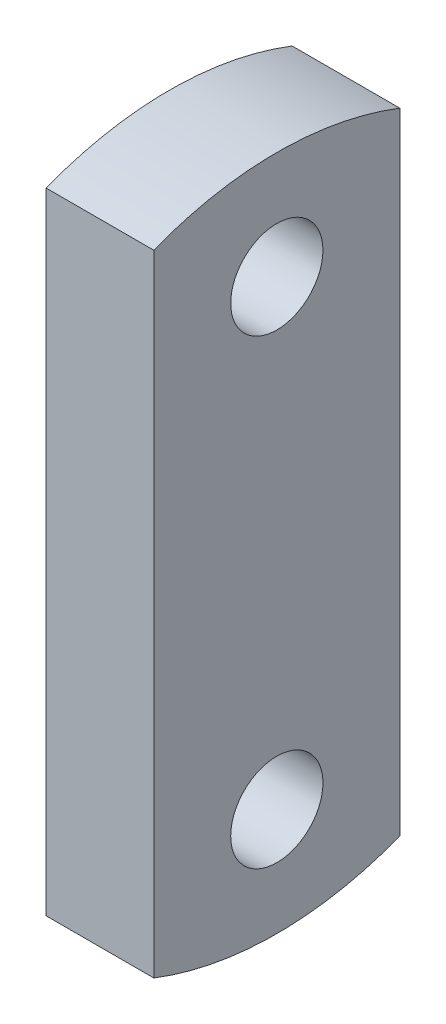
ISO-10303-21;
HEADER;
FILE_DESCRIPTION(('STEP AP214'),'2;1');
FILE_NAME('part.step','',(''),(''),'','','');
FILE_SCHEMA(('AUTOMOTIVE_DESIGN { 1 0 10303 214 1 1 1 1 }'));
ENDSEC;
DATA;
#1=APPLICATION_CONTEXT('core data for automotive mechanical design processes');
#2=APPLICATION_PROTOCOL_DEFINITION('international standard','automotive_design',2000,#1);
#3=PRODUCT_CONTEXT('',#1,'mechanical');
#4=PRODUCT('Part','Part','',(#3));
#5=PRODUCT_RELATED_PRODUCT_CATEGORY('part','',(#4));
#6=PRODUCT_DEFINITION_FORMATION('','',#4);
#7=PRODUCT_DEFINITION_CONTEXT('part definition',#1,'design');
#8=PRODUCT_DEFINITION('design','',#6,#7);
#9=PRODUCT_DEFINITION_SHAPE('','',#8);
#10=(LENGTH_UNIT() NAMED_UNIT(*) SI_UNIT(.MILLI.,.METRE.));
#11=(NAMED_UNIT(*) PLANE_ANGLE_UNIT() SI_UNIT($,.RADIAN.));
#12=(NAMED_UNIT(*) SI_UNIT($,.STERADIAN.) SOLID_ANGLE_UNIT());
#13=UNCERTAINTY_MEASURE_WITH_UNIT(LENGTH_MEASURE(1.E-05),#10,'distance_accuracy_value','');
#14=(GEOMETRIC_REPRESENTATION_CONTEXT(3) GLOBAL_UNCERTAINTY_ASSIGNED_CONTEXT((#13)) GLOBAL_UNIT_ASSIGNED_CONTEXT((#10,
#11,#12)) REPRESENTATION_CONTEXT('',''));
#15=CARTESIAN_POINT('',(0.,0.,0.));
#16=DIRECTION('',(0.,0.,1.));
#17=DIRECTION('',(1.,0.,0.));
#18=AXIS2_PLACEMENT_3D('',#15,#16,#17);
#19=CARTESIAN_POINT('',(35.,0.,0.));
#20=DIRECTION('',(1.,0.,0.));
#21=DIRECTION('',(0.,0.,-1.));
#22=AXIS2_PLACEMENT_3D('',#19,#20,#21);
#23=PLANE('',#22);
#24=CARTESIAN_POINT('',(35.,75.,0.));
#25=DIRECTION('',(1.,0.,0.));
#26=DIRECTION('',(0.,0.,-1.));
#27=AXIS2_PLACEMENT_3D('',#24,#25,#26);
#28=CIRCLE('',#27,15.);
#29=CARTESIAN_POINT('',(35.,75.,-15.));
#30=VERTEX_POINT('',#29);
#31=EDGE_CURVE('E120',#30,#30,#28,.T.);
#32=ORIENTED_EDGE('',*,*,#31,.F.);
#33=EDGE_LOOP('',(#32));
#34=FACE_BOUND('',#33,.T.);
#35=CARTESIAN_POINT('',(35.,0.,0.));
#36=DIRECTION('',(1.,0.,0.));
#37=DIRECTION('',(0.,0.,-1.));
#38=AXIS2_PLACEMENT_3D('',#35,#36,#37);
#39=CIRCLE('',#38,110.);
#40=CARTESIAN_POINT('',(35.,102.469507659596,-40.));
#41=VERTEX_POINT('',#40);
#42=CARTESIAN_POINT('',(35.,102.469507659596,40.));
#43=VERTEX_POINT('',#42);
#44=EDGE_CURVE('E98',#41,#43,#39,.T.);
#45=ORIENTED_EDGE('',*,*,#44,.T.);
#46=DIRECTION('',(0.,-1.,0.));
#47=VECTOR('',#46,1.);
#48=CARTESIAN_POINT('',(35.,-102.469507659596,40.));
#49=LINE('',#48,#47);
#50=CARTESIAN_POINT('',(35.,-102.469507659596,40.));
#51=VERTEX_POINT('',#50);
#52=EDGE_CURVE('E93',#43,#51,#49,.T.);
#53=ORIENTED_EDGE('',*,*,#52,.T.);
#54=CARTESIAN_POINT('',(35.,0.,0.));
#55=DIRECTION('',(1.,0.,0.));
#56=DIRECTION('',(0.,0.,-1.));
#57=AXIS2_PLACEMENT_3D('',#54,#55,#56);
#58=CIRCLE('',#57,110.);
#59=CARTESIAN_POINT('',(35.,-102.469507659596,-40.));
#60=VERTEX_POINT('',#59);
#61=EDGE_CURVE('E96',#51,#60,#58,.T.);
#62=ORIENTED_EDGE('',*,*,#61,.T.);
#63=DIRECTION('',(0.,1.,0.));
#64=VECTOR('',#63,1.);
#65=CARTESIAN_POINT('',(35.,-102.469507659596,-40.));
#66=LINE('',#65,#64);
#67=EDGE_CURVE('E63',#60,#41,#66,.T.);
#68=ORIENTED_EDGE('',*,*,#67,.T.);
#69=EDGE_LOOP('',(#45,#53,#62,#68));
#70=FACE_BOUND('',#69,.T.);
#71=CARTESIAN_POINT('',(35.,-75.,0.));
#72=DIRECTION('',(1.,0.,0.));
#73=DIRECTION('',(0.,0.,1.));
#74=AXIS2_PLACEMENT_3D('',#71,#72,#73);
#75=CIRCLE('',#74,15.);
#76=CARTESIAN_POINT('',(35.,-75.,15.));
#77=VERTEX_POINT('',#76);
#78=EDGE_CURVE('E141',#77,#77,#75,.T.);
#79=ORIENTED_EDGE('',*,*,#78,.F.);
#80=EDGE_LOOP('',(#79));
#81=FACE_BOUND('',#80,.T.);
#82=ADVANCED_FACE('F45',(#34,#70,#81),#23,.T.);
#83=CARTESIAN_POINT('',(0.,0.,0.));
#84=DIRECTION('',(1.,0.,0.));
#85=DIRECTION('',(0.,0.,-1.));
#86=AXIS2_PLACEMENT_3D('',#83,#84,#85);
#87=PLANE('',#86);
#88=CARTESIAN_POINT('',(0.,0.,0.));
#89=DIRECTION('',(1.,0.,0.));
#90=DIRECTION('',(0.,0.,-1.));
#91=AXIS2_PLACEMENT_3D('',#88,#89,#90);
#92=CIRCLE('',#91,110.);
#93=CARTESIAN_POINT('',(0.,102.469507659596,-40.));
#94=VERTEX_POINT('',#93);
#95=CARTESIAN_POINT('',(0.,102.469507659596,40.));
#96=VERTEX_POINT('',#95);
#97=EDGE_CURVE('E116',#94,#96,#92,.T.);
#98=ORIENTED_EDGE('',*,*,#97,.F.);
#99=DIRECTION('',(0.,1.,0.));
#100=VECTOR('',#99,1.);
#101=CARTESIAN_POINT('',(0.,-102.469507659596,-40.));
#102=LINE('',#101,#100);
#103=CARTESIAN_POINT('',(0.,-102.469507659596,-40.));
#104=VERTEX_POINT('',#103);
#105=EDGE_CURVE('E86',#104,#94,#102,.T.);
#106=ORIENTED_EDGE('',*,*,#105,.F.);
#107=CARTESIAN_POINT('',(0.,0.,0.));
#108=DIRECTION('',(1.,0.,0.));
#109=DIRECTION('',(0.,0.,-1.));
#110=AXIS2_PLACEMENT_3D('',#107,#108,#109);
#111=CIRCLE('',#110,110.);
#112=CARTESIAN_POINT('',(0.,-102.469507659596,40.));
#113=VERTEX_POINT('',#112);
#114=EDGE_CURVE('E80',#113,#104,#111,.T.);
#115=ORIENTED_EDGE('',*,*,#114,.F.);
#116=DIRECTION('',(0.,-1.,0.));
#117=VECTOR('',#116,1.);
#118=CARTESIAN_POINT('',(0.,-102.469507659596,40.));
#119=LINE('',#118,#117);
#120=EDGE_CURVE('E103',#96,#113,#119,.T.);
#121=ORIENTED_EDGE('',*,*,#120,.F.);
#122=EDGE_LOOP('',(#98,#106,#115,#121));
#123=FACE_BOUND('',#122,.T.);
#124=CARTESIAN_POINT('',(0.,75.,0.));
#125=DIRECTION('',(1.,0.,0.));
#126=DIRECTION('',(0.,0.,-1.));
#127=AXIS2_PLACEMENT_3D('',#124,#125,#126);
#128=CIRCLE('',#127,15.);
#129=CARTESIAN_POINT('',(0.,75.,-15.));
#130=VERTEX_POINT('',#129);
#131=EDGE_CURVE('E137',#130,#130,#128,.T.);
#132=ORIENTED_EDGE('',*,*,#131,.T.);
#133=EDGE_LOOP('',(#132));
#134=FACE_BOUND('',#133,.T.);
#135=CARTESIAN_POINT('',(0.,-75.,0.));
#136=DIRECTION('',(1.,0.,0.));
#137=DIRECTION('',(0.,0.,1.));
#138=AXIS2_PLACEMENT_3D('',#135,#136,#137);
#139=CIRCLE('',#138,15.);
#140=CARTESIAN_POINT('',(0.,-75.,15.));
#141=VERTEX_POINT('',#140);
#142=EDGE_CURVE('E145',#141,#141,#139,.T.);
#143=ORIENTED_EDGE('',*,*,#142,.T.);
#144=EDGE_LOOP('',(#143));
#145=FACE_BOUND('',#144,.T.);
#146=ADVANCED_FACE('F132',(#123,#134,#145),#87,.F.);
#147=CARTESIAN_POINT('',(35.,0.,0.));
#148=DIRECTION('',(-1.,0.,0.));
#149=DIRECTION('',(0.,0.,1.));
#150=AXIS2_PLACEMENT_3D('',#147,#148,#149);
#151=CYLINDRICAL_SURFACE('',#150,110.);
#152=ORIENTED_EDGE('',*,*,#97,.T.);
#153=DIRECTION('',(-1.,0.,0.));
#154=VECTOR('',#153,1.);
#155=CARTESIAN_POINT('',(35.,102.469507659596,40.));
#156=LINE('',#155,#154);
#157=EDGE_CURVE('E11',#43,#96,#156,.T.);
#158=ORIENTED_EDGE('',*,*,#157,.F.);
#159=ORIENTED_EDGE('',*,*,#44,.F.);
#160=DIRECTION('',(-1.,0.,0.));
#161=VECTOR('',#160,1.);
#162=CARTESIAN_POINT('',(35.,102.469507659596,-40.));
#163=LINE('',#162,#161);
#164=EDGE_CURVE('E112',#41,#94,#163,.T.);
#165=ORIENTED_EDGE('',*,*,#164,.T.);
#166=EDGE_LOOP('',(#152,#158,#159,#165));
#167=FACE_BOUND('',#166,.T.);
#168=ADVANCED_FACE('F47',(#167),#151,.T.);
#169=CARTESIAN_POINT('',(35.,-102.469507659596,40.));
#170=DIRECTION('',(0.,0.,-1.));
#171=DIRECTION('',(-1.,0.,0.));
#172=AXIS2_PLACEMENT_3D('',#169,#170,#171);
#173=PLANE('',#172);
#174=ORIENTED_EDGE('',*,*,#120,.T.);
#175=DIRECTION('',(-1.,0.,0.));
#176=VECTOR('',#175,1.);
#177=CARTESIAN_POINT('',(35.,-102.469507659596,40.));
#178=LINE('',#177,#176);
#179=EDGE_CURVE('E55',#51,#113,#178,.T.);
#180=ORIENTED_EDGE('',*,*,#179,.F.);
#181=ORIENTED_EDGE('',*,*,#52,.F.);
#182=ORIENTED_EDGE('',*,*,#157,.T.);
#183=EDGE_LOOP('',(#174,#180,#181,#182));
#184=FACE_BOUND('',#183,.T.);
#185=ADVANCED_FACE('F102',(#184),#173,.F.);
#186=CARTESIAN_POINT('',(35.,0.,0.));
#187=DIRECTION('',(-1.,0.,0.));
#188=DIRECTION('',(0.,0.,1.));
#189=AXIS2_PLACEMENT_3D('',#186,#187,#188);
#190=CYLINDRICAL_SURFACE('',#189,110.);
#191=ORIENTED_EDGE('',*,*,#114,.T.);
#192=DIRECTION('',(-1.,0.,0.));
#193=VECTOR('',#192,1.);
#194=CARTESIAN_POINT('',(35.,-102.469507659596,-40.));
#195=LINE('',#194,#193);
#196=EDGE_CURVE('E105',#60,#104,#195,.T.);
#197=ORIENTED_EDGE('',*,*,#196,.F.);
#198=ORIENTED_EDGE('',*,*,#61,.F.);
#199=ORIENTED_EDGE('',*,*,#179,.T.);
#200=EDGE_LOOP('',(#191,#197,#198,#199));
#201=FACE_BOUND('',#200,.T.);
#202=ADVANCED_FACE('F106',(#201),#190,.T.);
#203=CARTESIAN_POINT('',(35.,-102.469507659596,-40.));
#204=DIRECTION('',(0.,0.,1.));
#205=DIRECTION('',(1.,0.,0.));
#206=AXIS2_PLACEMENT_3D('',#203,#204,#205);
#207=PLANE('',#206);
#208=ORIENTED_EDGE('',*,*,#105,.T.);
#209=ORIENTED_EDGE('',*,*,#164,.F.);
#210=ORIENTED_EDGE('',*,*,#67,.F.);
#211=ORIENTED_EDGE('',*,*,#196,.T.);
#212=EDGE_LOOP('',(#208,#209,#210,#211));
#213=FACE_BOUND('',#212,.T.);
#214=ADVANCED_FACE('F129',(#213),#207,.F.);
#215=CARTESIAN_POINT('',(35.,75.,0.));
#216=DIRECTION('',(-1.,0.,0.));
#217=DIRECTION('',(0.,0.,1.));
#218=AXIS2_PLACEMENT_3D('',#215,#216,#217);
#219=CYLINDRICAL_SURFACE('',#218,15.);
#220=ORIENTED_EDGE('',*,*,#31,.T.);
#221=EDGE_LOOP('',(#220));
#222=FACE_BOUND('',#221,.T.);
#223=ORIENTED_EDGE('',*,*,#131,.F.);
#224=EDGE_LOOP('',(#223));
#225=FACE_BOUND('',#224,.T.);
#226=ADVANCED_FACE('F162',(#222,#225),#219,.F.);
#227=CARTESIAN_POINT('',(35.,-75.,0.));
#228=DIRECTION('',(-1.,0.,0.));
#229=DIRECTION('',(0.,0.,1.));
#230=AXIS2_PLACEMENT_3D('',#227,#228,#229);
#231=CYLINDRICAL_SURFACE('',#230,15.);
#232=ORIENTED_EDGE('',*,*,#78,.T.);
#233=EDGE_LOOP('',(#232));
#234=FACE_BOUND('',#233,.T.);
#235=ORIENTED_EDGE('',*,*,#142,.F.);
#236=EDGE_LOOP('',(#235));
#237=FACE_BOUND('',#236,.T.);
#238=ADVANCED_FACE('F152',(#234,#237),#231,.F.);
#239=CLOSED_SHELL('',(#82,#146,#168,#185,#202,#214,#226,#238));
#240=MANIFOLD_SOLID_BREP('B2',#239);
#241=ADVANCED_BREP_SHAPE_REPRESENTATION('',(#18,#240),#14);
#242=SHAPE_DEFINITION_REPRESENTATION(#9,#241);
ENDSEC;
END-ISO-10303-21;
